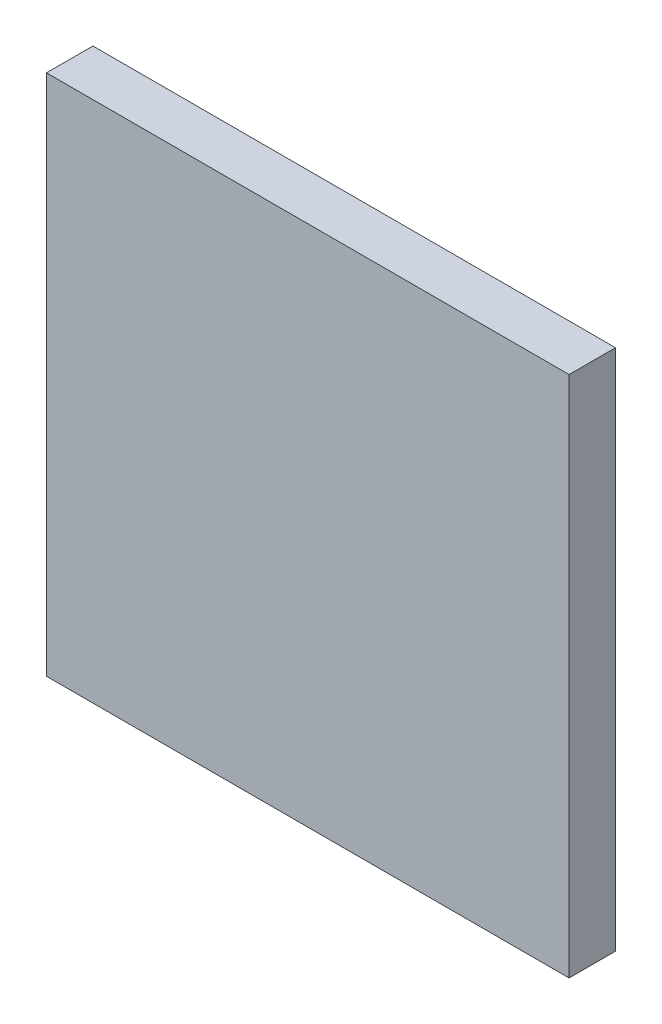
ISO-10303-21;
HEADER;
FILE_DESCRIPTION(('STEP AP214'),'2;1');
FILE_NAME('part.step','',(''),(''),'','','');
FILE_SCHEMA(('AUTOMOTIVE_DESIGN { 1 0 10303 214 1 1 1 1 }'));
ENDSEC;
DATA;
#1=APPLICATION_CONTEXT('core data for automotive mechanical design processes');
#2=APPLICATION_PROTOCOL_DEFINITION('international standard','automotive_design',2000,#1);
#3=PRODUCT_CONTEXT('',#1,'mechanical');
#4=PRODUCT('Part','Part','',(#3));
#5=PRODUCT_RELATED_PRODUCT_CATEGORY('part','',(#4));
#6=PRODUCT_DEFINITION_FORMATION('','',#4);
#7=PRODUCT_DEFINITION_CONTEXT('part definition',#1,'design');
#8=PRODUCT_DEFINITION('design','',#6,#7);
#9=PRODUCT_DEFINITION_SHAPE('','',#8);
#10=(LENGTH_UNIT() NAMED_UNIT(*) SI_UNIT(.MILLI.,.METRE.));
#11=(NAMED_UNIT(*) PLANE_ANGLE_UNIT() SI_UNIT($,.RADIAN.));
#12=(NAMED_UNIT(*) SI_UNIT($,.STERADIAN.) SOLID_ANGLE_UNIT());
#13=UNCERTAINTY_MEASURE_WITH_UNIT(LENGTH_MEASURE(1.E-05),#10,'distance_accuracy_value','');
#14=(GEOMETRIC_REPRESENTATION_CONTEXT(3) GLOBAL_UNCERTAINTY_ASSIGNED_CONTEXT((#13)) GLOBAL_UNIT_ASSIGNED_CONTEXT((#10,
#11,#12)) REPRESENTATION_CONTEXT('',''));
#15=CARTESIAN_POINT('',(0.,0.,0.));
#16=DIRECTION('',(0.,0.,1.));
#17=DIRECTION('',(1.,0.,0.));
#18=AXIS2_PLACEMENT_3D('',#15,#16,#17);
#19=CARTESIAN_POINT('',(0.,0.,4.));
#20=DIRECTION('',(1.,0.,0.));
#21=DIRECTION('',(0.,0.,-1.));
#22=AXIS2_PLACEMENT_3D('',#19,#20,#21);
#23=PLANE('',#22);
#24=DIRECTION('',(0.,-1.,0.));
#25=VECTOR('',#24,1.);
#26=CARTESIAN_POINT('',(0.,0.,0.));
#27=LINE('',#26,#25);
#28=CARTESIAN_POINT('',(0.,45.,0.));
#29=VERTEX_POINT('',#28);
#30=CARTESIAN_POINT('',(0.,0.,0.));
#31=VERTEX_POINT('',#30);
#32=EDGE_CURVE('E107',#29,#31,#27,.T.);
#33=ORIENTED_EDGE('',*,*,#32,.T.);
#34=DIRECTION('',(0.,0.,-1.));
#35=VECTOR('',#34,1.);
#36=CARTESIAN_POINT('',(0.,0.,4.));
#37=LINE('',#36,#35);
#38=CARTESIAN_POINT('',(0.,0.,4.));
#39=VERTEX_POINT('',#38);
#40=EDGE_CURVE('E11',#39,#31,#37,.T.);
#41=ORIENTED_EDGE('',*,*,#40,.F.);
#42=DIRECTION('',(0.,-1.,0.));
#43=VECTOR('',#42,1.);
#44=CARTESIAN_POINT('',(0.,0.,4.));
#45=LINE('',#44,#43);
#46=CARTESIAN_POINT('',(0.,45.,4.));
#47=VERTEX_POINT('',#46);
#48=EDGE_CURVE('E91',#47,#39,#45,.T.);
#49=ORIENTED_EDGE('',*,*,#48,.F.);
#50=DIRECTION('',(0.,0.,-1.));
#51=VECTOR('',#50,1.);
#52=CARTESIAN_POINT('',(0.,45.,4.));
#53=LINE('',#52,#51);
#54=EDGE_CURVE('E103',#47,#29,#53,.T.);
#55=ORIENTED_EDGE('',*,*,#54,.T.);
#56=EDGE_LOOP('',(#33,#41,#49,#55));
#57=FACE_BOUND('',#56,.T.);
#58=ADVANCED_FACE('F39',(#57),#23,.F.);
#59=CARTESIAN_POINT('',(0.,0.,4.));
#60=DIRECTION('',(0.,1.,0.));
#61=DIRECTION('',(0.,0.,1.));
#62=AXIS2_PLACEMENT_3D('',#59,#60,#61);
#63=PLANE('',#62);
#64=DIRECTION('',(1.,0.,0.));
#65=VECTOR('',#64,1.);
#66=CARTESIAN_POINT('',(0.,0.,0.));
#67=LINE('',#66,#65);
#68=CARTESIAN_POINT('',(45.,0.,0.));
#69=VERTEX_POINT('',#68);
#70=EDGE_CURVE('E96',#31,#69,#67,.T.);
#71=ORIENTED_EDGE('',*,*,#70,.T.);
#72=DIRECTION('',(0.,0.,-1.));
#73=VECTOR('',#72,1.);
#74=CARTESIAN_POINT('',(45.,0.,4.));
#75=LINE('',#74,#73);
#76=CARTESIAN_POINT('',(45.,0.,4.));
#77=VERTEX_POINT('',#76);
#78=EDGE_CURVE('E48',#77,#69,#75,.T.);
#79=ORIENTED_EDGE('',*,*,#78,.F.);
#80=DIRECTION('',(1.,0.,0.));
#81=VECTOR('',#80,1.);
#82=CARTESIAN_POINT('',(0.,0.,4.));
#83=LINE('',#82,#81);
#84=EDGE_CURVE('E86',#39,#77,#83,.T.);
#85=ORIENTED_EDGE('',*,*,#84,.F.);
#86=ORIENTED_EDGE('',*,*,#40,.T.);
#87=EDGE_LOOP('',(#71,#79,#85,#86));
#88=FACE_BOUND('',#87,.T.);
#89=ADVANCED_FACE('F95',(#88),#63,.F.);
#90=CARTESIAN_POINT('',(45.,0.,4.));
#91=DIRECTION('',(-1.,0.,0.));
#92=DIRECTION('',(0.,0.,1.));
#93=AXIS2_PLACEMENT_3D('',#90,#91,#92);
#94=PLANE('',#93);
#95=DIRECTION('',(0.,1.,0.));
#96=VECTOR('',#95,1.);
#97=CARTESIAN_POINT('',(45.,0.,0.));
#98=LINE('',#97,#96);
#99=CARTESIAN_POINT('',(45.,45.,0.));
#100=VERTEX_POINT('',#99);
#101=EDGE_CURVE('E73',#69,#100,#98,.T.);
#102=ORIENTED_EDGE('',*,*,#101,.T.);
#103=DIRECTION('',(0.,0.,-1.));
#104=VECTOR('',#103,1.);
#105=CARTESIAN_POINT('',(45.,45.,4.));
#106=LINE('',#105,#104);
#107=CARTESIAN_POINT('',(45.,45.,4.));
#108=VERTEX_POINT('',#107);
#109=EDGE_CURVE('E98',#108,#100,#106,.T.);
#110=ORIENTED_EDGE('',*,*,#109,.F.);
#111=DIRECTION('',(0.,1.,0.));
#112=VECTOR('',#111,1.);
#113=CARTESIAN_POINT('',(45.,0.,4.));
#114=LINE('',#113,#112);
#115=EDGE_CURVE('E89',#77,#108,#114,.T.);
#116=ORIENTED_EDGE('',*,*,#115,.F.);
#117=ORIENTED_EDGE('',*,*,#78,.T.);
#118=EDGE_LOOP('',(#102,#110,#116,#117));
#119=FACE_BOUND('',#118,.T.);
#120=ADVANCED_FACE('F99',(#119),#94,.F.);
#121=CARTESIAN_POINT('',(0.,45.,4.));
#122=DIRECTION('',(0.,-1.,0.));
#123=DIRECTION('',(0.,0.,-1.));
#124=AXIS2_PLACEMENT_3D('',#121,#122,#123);
#125=PLANE('',#124);
#126=DIRECTION('',(-1.,0.,0.));
#127=VECTOR('',#126,1.);
#128=CARTESIAN_POINT('',(0.,45.,0.));
#129=LINE('',#128,#127);
#130=EDGE_CURVE('E79',#100,#29,#129,.T.);
#131=ORIENTED_EDGE('',*,*,#130,.T.);
#132=ORIENTED_EDGE('',*,*,#54,.F.);
#133=DIRECTION('',(-1.,0.,0.));
#134=VECTOR('',#133,1.);
#135=CARTESIAN_POINT('',(0.,45.,4.));
#136=LINE('',#135,#134);
#137=EDGE_CURVE('E56',#108,#47,#136,.T.);
#138=ORIENTED_EDGE('',*,*,#137,.F.);
#139=ORIENTED_EDGE('',*,*,#109,.T.);
#140=EDGE_LOOP('',(#131,#132,#138,#139));
#141=FACE_BOUND('',#140,.T.);
#142=ADVANCED_FACE('F120',(#141),#125,.F.);
#143=CARTESIAN_POINT('',(0.,0.,4.));
#144=DIRECTION('',(0.,0.,-1.));
#145=DIRECTION('',(-1.,0.,0.));
#146=AXIS2_PLACEMENT_3D('',#143,#144,#145);
#147=PLANE('',#146);
#148=ORIENTED_EDGE('',*,*,#48,.T.);
#149=ORIENTED_EDGE('',*,*,#84,.T.);
#150=ORIENTED_EDGE('',*,*,#115,.T.);
#151=ORIENTED_EDGE('',*,*,#137,.T.);
#152=EDGE_LOOP('',(#148,#149,#150,#151));
#153=FACE_BOUND('',#152,.T.);
#154=ADVANCED_FACE('F87',(#153),#147,.F.);
#155=CARTESIAN_POINT('',(0.,0.,0.));
#156=DIRECTION('',(0.,0.,-1.));
#157=DIRECTION('',(-1.,0.,0.));
#158=AXIS2_PLACEMENT_3D('',#155,#156,#157);
#159=PLANE('',#158);
#160=ORIENTED_EDGE('',*,*,#32,.F.);
#161=ORIENTED_EDGE('',*,*,#130,.F.);
#162=ORIENTED_EDGE('',*,*,#101,.F.);
#163=ORIENTED_EDGE('',*,*,#70,.F.);
#164=EDGE_LOOP('',(#160,#161,#162,#163));
#165=FACE_BOUND('',#164,.T.);
#166=ADVANCED_FACE('F123',(#165),#159,.T.);
#167=CLOSED_SHELL('',(#58,#89,#120,#142,#154,#166));
#168=MANIFOLD_SOLID_BREP('B2',#167);
#169=ADVANCED_BREP_SHAPE_REPRESENTATION('',(#18,#168),#14);
#170=SHAPE_DEFINITION_REPRESENTATION(#9,#169);
ENDSEC;
END-ISO-10303-21;
